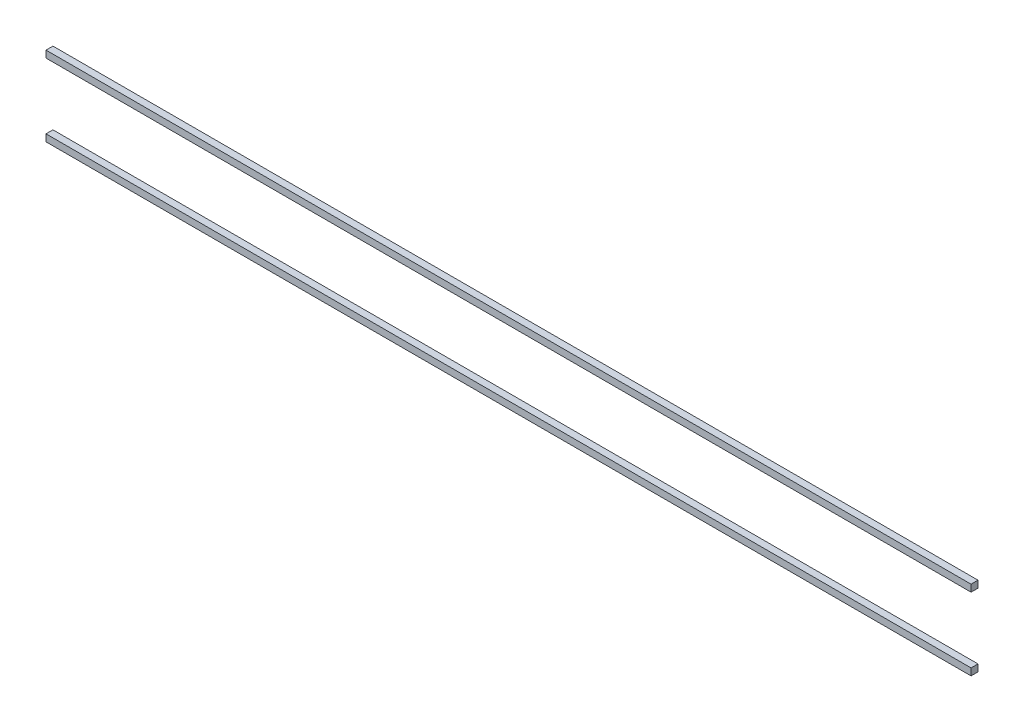
ISO-10303-21;
HEADER;
FILE_DESCRIPTION(('STEP AP214'),'2;1');
FILE_NAME('part.step','',(''),(''),'','','');
FILE_SCHEMA(('AUTOMOTIVE_DESIGN { 1 0 10303 214 1 1 1 1 }'));
ENDSEC;
DATA;
#1=APPLICATION_CONTEXT('core data for automotive mechanical design processes');
#2=APPLICATION_PROTOCOL_DEFINITION('international standard','automotive_design',2000,#1);
#3=PRODUCT_CONTEXT('',#1,'mechanical');
#4=PRODUCT('Part','Part','',(#3));
#5=PRODUCT_RELATED_PRODUCT_CATEGORY('part','',(#4));
#6=PRODUCT_DEFINITION_FORMATION('','',#4);
#7=PRODUCT_DEFINITION_CONTEXT('part definition',#1,'design');
#8=PRODUCT_DEFINITION('design','',#6,#7);
#9=PRODUCT_DEFINITION_SHAPE('','',#8);
#10=(LENGTH_UNIT() NAMED_UNIT(*) SI_UNIT(.MILLI.,.METRE.));
#11=(NAMED_UNIT(*) PLANE_ANGLE_UNIT() SI_UNIT($,.RADIAN.));
#12=(NAMED_UNIT(*) SI_UNIT($,.STERADIAN.) SOLID_ANGLE_UNIT());
#13=UNCERTAINTY_MEASURE_WITH_UNIT(LENGTH_MEASURE(1.E-05),#10,'distance_accuracy_value','');
#14=(GEOMETRIC_REPRESENTATION_CONTEXT(3) GLOBAL_UNCERTAINTY_ASSIGNED_CONTEXT((#13)) GLOBAL_UNIT_ASSIGNED_CONTEXT((#10,
#11,#12)) REPRESENTATION_CONTEXT('',''));
#15=CARTESIAN_POINT('',(0.,0.,0.));
#16=DIRECTION('',(0.,0.,1.));
#17=DIRECTION('',(1.,0.,0.));
#18=AXIS2_PLACEMENT_3D('',#15,#16,#17);
#19=CARTESIAN_POINT('',(0.,15.,3.175));
#20=DIRECTION('',(0.,1.,0.));
#21=DIRECTION('',(0.,0.,1.));
#22=AXIS2_PLACEMENT_3D('',#19,#20,#21);
#23=PLANE('',#22);
#24=DIRECTION('',(1.,0.,0.));
#25=VECTOR('',#24,1.);
#26=CARTESIAN_POINT('',(0.,15.,0.));
#27=LINE('',#26,#25);
#28=CARTESIAN_POINT('',(-18.175,15.,0.));
#29=VERTEX_POINT('',#28);
#30=CARTESIAN_POINT('',(405.,15.,0.));
#31=VERTEX_POINT('',#30);
#32=EDGE_CURVE('E122',#29,#31,#27,.T.);
#33=ORIENTED_EDGE('',*,*,#32,.F.);
#34=DIRECTION('',(0.,0.,-1.));
#35=VECTOR('',#34,1.);
#36=CARTESIAN_POINT('',(-18.175,15.,3.175));
#37=LINE('',#36,#35);
#38=CARTESIAN_POINT('',(-18.175,15.,3.175));
#39=VERTEX_POINT('',#38);
#40=EDGE_CURVE('E12',#39,#29,#37,.T.);
#41=ORIENTED_EDGE('',*,*,#40,.F.);
#42=DIRECTION('',(1.,0.,0.));
#43=VECTOR('',#42,1.);
#44=CARTESIAN_POINT('',(0.,15.,3.175));
#45=LINE('',#44,#43);
#46=CARTESIAN_POINT('',(405.,15.,3.175));
#47=VERTEX_POINT('',#46);
#48=EDGE_CURVE('E112',#39,#47,#45,.T.);
#49=ORIENTED_EDGE('',*,*,#48,.T.);
#50=DIRECTION('',(0.,0.,-1.));
#51=VECTOR('',#50,1.);
#52=CARTESIAN_POINT('',(405.,15.,3.175));
#53=LINE('',#52,#51);
#54=EDGE_CURVE('E91',#47,#31,#53,.T.);
#55=ORIENTED_EDGE('',*,*,#54,.T.);
#56=EDGE_LOOP('',(#33,#41,#49,#55));
#57=FACE_BOUND('',#56,.T.);
#58=ADVANCED_FACE('F52',(#57),#23,.T.);
#59=CARTESIAN_POINT('',(-18.175,0.,3.175));
#60=DIRECTION('',(-1.,0.,0.));
#61=DIRECTION('',(0.,0.,1.));
#62=AXIS2_PLACEMENT_3D('',#59,#60,#61);
#63=PLANE('',#62);
#64=DIRECTION('',(0.,1.,0.));
#65=VECTOR('',#64,1.);
#66=CARTESIAN_POINT('',(-18.175,0.,0.));
#67=LINE('',#66,#65);
#68=CARTESIAN_POINT('',(-18.175,11.825,0.));
#69=VERTEX_POINT('',#68);
#70=EDGE_CURVE('E104',#69,#29,#67,.T.);
#71=ORIENTED_EDGE('',*,*,#70,.F.);
#72=DIRECTION('',(0.,0.,-1.));
#73=VECTOR('',#72,1.);
#74=CARTESIAN_POINT('',(-18.175,11.825,3.175));
#75=LINE('',#74,#73);
#76=CARTESIAN_POINT('',(-18.175,11.825,3.175));
#77=VERTEX_POINT('',#76);
#78=EDGE_CURVE('E61',#77,#69,#75,.T.);
#79=ORIENTED_EDGE('',*,*,#78,.F.);
#80=DIRECTION('',(0.,1.,0.));
#81=VECTOR('',#80,1.);
#82=CARTESIAN_POINT('',(-18.175,0.,3.175));
#83=LINE('',#82,#81);
#84=EDGE_CURVE('E102',#77,#39,#83,.T.);
#85=ORIENTED_EDGE('',*,*,#84,.T.);
#86=ORIENTED_EDGE('',*,*,#40,.T.);
#87=EDGE_LOOP('',(#71,#79,#85,#86));
#88=FACE_BOUND('',#87,.T.);
#89=ADVANCED_FACE('F100',(#88),#63,.T.);
#90=CARTESIAN_POINT('',(0.,11.825,3.175));
#91=DIRECTION('',(0.,1.,0.));
#92=DIRECTION('',(-1.,0.,0.));
#93=AXIS2_PLACEMENT_3D('',#90,#91,#92);
#94=PLANE('',#93);
#95=DIRECTION('',(1.,0.,0.));
#96=VECTOR('',#95,1.);
#97=CARTESIAN_POINT('',(0.,11.825,0.));
#98=LINE('',#97,#96);
#99=CARTESIAN_POINT('',(405.,11.825,0.));
#100=VERTEX_POINT('',#99);
#101=EDGE_CURVE('E84',#69,#100,#98,.T.);
#102=ORIENTED_EDGE('',*,*,#101,.T.);
#103=DIRECTION('',(0.,0.,-1.));
#104=VECTOR('',#103,1.);
#105=CARTESIAN_POINT('',(405.,11.825,3.175));
#106=LINE('',#105,#104);
#107=CARTESIAN_POINT('',(405.,11.825,3.175));
#108=VERTEX_POINT('',#107);
#109=EDGE_CURVE('E106',#108,#100,#106,.T.);
#110=ORIENTED_EDGE('',*,*,#109,.F.);
#111=DIRECTION('',(1.,0.,0.));
#112=VECTOR('',#111,1.);
#113=CARTESIAN_POINT('',(0.,11.825,3.175));
#114=LINE('',#113,#112);
#115=EDGE_CURVE('E107',#77,#108,#114,.T.);
#116=ORIENTED_EDGE('',*,*,#115,.F.);
#117=ORIENTED_EDGE('',*,*,#78,.T.);
#118=EDGE_LOOP('',(#102,#110,#116,#117));
#119=FACE_BOUND('',#118,.T.);
#120=ADVANCED_FACE('F108',(#119),#94,.F.);
#121=CARTESIAN_POINT('',(405.,0.,3.175));
#122=DIRECTION('',(-1.,0.,0.));
#123=DIRECTION('',(0.,0.,1.));
#124=AXIS2_PLACEMENT_3D('',#121,#122,#123);
#125=PLANE('',#124);
#126=DIRECTION('',(0.,1.,0.));
#127=VECTOR('',#126,1.);
#128=CARTESIAN_POINT('',(405.,0.,0.));
#129=LINE('',#128,#127);
#130=EDGE_CURVE('E117',#100,#31,#129,.T.);
#131=ORIENTED_EDGE('',*,*,#130,.T.);
#132=ORIENTED_EDGE('',*,*,#54,.F.);
#133=DIRECTION('',(0.,1.,0.));
#134=VECTOR('',#133,1.);
#135=CARTESIAN_POINT('',(405.,0.,3.175));
#136=LINE('',#135,#134);
#137=EDGE_CURVE('E69',#108,#47,#136,.T.);
#138=ORIENTED_EDGE('',*,*,#137,.F.);
#139=ORIENTED_EDGE('',*,*,#109,.T.);
#140=EDGE_LOOP('',(#131,#132,#138,#139));
#141=FACE_BOUND('',#140,.T.);
#142=ADVANCED_FACE('F136',(#141),#125,.F.);
#143=CARTESIAN_POINT('',(0.,0.,3.175));
#144=DIRECTION('',(0.,0.,1.));
#145=DIRECTION('',(1.,0.,0.));
#146=AXIS2_PLACEMENT_3D('',#143,#144,#145);
#147=PLANE('',#146);
#148=ORIENTED_EDGE('',*,*,#48,.F.);
#149=ORIENTED_EDGE('',*,*,#84,.F.);
#150=ORIENTED_EDGE('',*,*,#115,.T.);
#151=ORIENTED_EDGE('',*,*,#137,.T.);
#152=EDGE_LOOP('',(#148,#149,#150,#151));
#153=FACE_BOUND('',#152,.T.);
#154=ADVANCED_FACE('F111',(#153),#147,.T.);
#155=CARTESIAN_POINT('',(0.,0.,0.));
#156=DIRECTION('',(0.,0.,1.));
#157=DIRECTION('',(1.,0.,0.));
#158=AXIS2_PLACEMENT_3D('',#155,#156,#157);
#159=PLANE('',#158);
#160=ORIENTED_EDGE('',*,*,#32,.T.);
#161=ORIENTED_EDGE('',*,*,#130,.F.);
#162=ORIENTED_EDGE('',*,*,#101,.F.);
#163=ORIENTED_EDGE('',*,*,#70,.T.);
#164=EDGE_LOOP('',(#160,#161,#162,#163));
#165=FACE_BOUND('',#164,.T.);
#166=ADVANCED_FACE('F138',(#165),#159,.F.);
#167=CLOSED_SHELL('',(#58,#89,#120,#142,#154,#166));
#168=MANIFOLD_SOLID_BREP('B2',#167);
#169=CARTESIAN_POINT('',(0.,45.,3.175));
#170=DIRECTION('',(0.,1.,0.));
#171=DIRECTION('',(0.,0.,1.));
#172=AXIS2_PLACEMENT_3D('',#169,#170,#171);
#173=PLANE('',#172);
#174=DIRECTION('',(1.,0.,0.));
#175=VECTOR('',#174,1.);
#176=CARTESIAN_POINT('',(0.,45.,0.));
#177=LINE('',#176,#175);
#178=CARTESIAN_POINT('',(-18.175,45.,0.));
#179=VERTEX_POINT('',#178);
#180=CARTESIAN_POINT('',(405.,45.,0.));
#181=VERTEX_POINT('',#180);
#182=EDGE_CURVE('E276',#179,#181,#177,.T.);
#183=ORIENTED_EDGE('',*,*,#182,.T.);
#184=DIRECTION('',(0.,0.,-1.));
#185=VECTOR('',#184,1.);
#186=CARTESIAN_POINT('',(405.,45.,3.175));
#187=LINE('',#186,#185);
#188=CARTESIAN_POINT('',(405.,45.,3.175));
#189=VERTEX_POINT('',#188);
#190=EDGE_CURVE('E50',#189,#181,#187,.T.);
#191=ORIENTED_EDGE('',*,*,#190,.F.);
#192=DIRECTION('',(1.,0.,0.));
#193=VECTOR('',#192,1.);
#194=CARTESIAN_POINT('',(0.,45.,3.175));
#195=LINE('',#194,#193);
#196=CARTESIAN_POINT('',(-18.175,45.,3.175));
#197=VERTEX_POINT('',#196);
#198=EDGE_CURVE('E255',#197,#189,#195,.T.);
#199=ORIENTED_EDGE('',*,*,#198,.F.);
#200=DIRECTION('',(0.,0.,-1.));
#201=VECTOR('',#200,1.);
#202=CARTESIAN_POINT('',(-18.175,45.,3.175));
#203=LINE('',#202,#201);
#204=EDGE_CURVE('E272',#197,#179,#203,.T.);
#205=ORIENTED_EDGE('',*,*,#204,.T.);
#206=EDGE_LOOP('',(#183,#191,#199,#205));
#207=FACE_BOUND('',#206,.T.);
#208=ADVANCED_FACE('F207',(#207),#173,.F.);
#209=CARTESIAN_POINT('',(405.,0.,3.175));
#210=DIRECTION('',(-1.,0.,0.));
#211=DIRECTION('',(0.,0.,1.));
#212=AXIS2_PLACEMENT_3D('',#209,#210,#211);
#213=PLANE('',#212);
#214=DIRECTION('',(0.,1.,0.));
#215=VECTOR('',#214,1.);
#216=CARTESIAN_POINT('',(405.,0.,0.));
#217=LINE('',#216,#215);
#218=CARTESIAN_POINT('',(405.,48.175,0.));
#219=VERTEX_POINT('',#218);
#220=EDGE_CURVE('E261',#181,#219,#217,.T.);
#221=ORIENTED_EDGE('',*,*,#220,.T.);
#222=DIRECTION('',(0.,0.,-1.));
#223=VECTOR('',#222,1.);
#224=CARTESIAN_POINT('',(405.,48.175,3.175));
#225=LINE('',#224,#223);
#226=CARTESIAN_POINT('',(405.,48.175,3.175));
#227=VERTEX_POINT('',#226);
#228=EDGE_CURVE('E216',#227,#219,#225,.T.);
#229=ORIENTED_EDGE('',*,*,#228,.F.);
#230=DIRECTION('',(0.,1.,0.));
#231=VECTOR('',#230,1.);
#232=CARTESIAN_POINT('',(405.,0.,3.175));
#233=LINE('',#232,#231);
#234=EDGE_CURVE('E250',#189,#227,#233,.T.);
#235=ORIENTED_EDGE('',*,*,#234,.F.);
#236=ORIENTED_EDGE('',*,*,#190,.T.);
#237=EDGE_LOOP('',(#221,#229,#235,#236));
#238=FACE_BOUND('',#237,.T.);
#239=ADVANCED_FACE('F260',(#238),#213,.F.);
#240=CARTESIAN_POINT('',(0.,48.175,3.175));
#241=DIRECTION('',(0.,1.,0.));
#242=DIRECTION('',(0.,0.,1.));
#243=AXIS2_PLACEMENT_3D('',#240,#241,#242);
#244=PLANE('',#243);
#245=DIRECTION('',(1.,0.,0.));
#246=VECTOR('',#245,1.);
#247=CARTESIAN_POINT('',(0.,48.175,0.));
#248=LINE('',#247,#246);
#249=CARTESIAN_POINT('',(-18.175,48.175,0.));
#250=VERTEX_POINT('',#249);
#251=EDGE_CURVE('E281',#250,#219,#248,.T.);
#252=ORIENTED_EDGE('',*,*,#251,.F.);
#253=DIRECTION('',(0.,0.,-1.));
#254=VECTOR('',#253,1.);
#255=CARTESIAN_POINT('',(-18.175,48.175,3.175));
#256=LINE('',#255,#254);
#257=CARTESIAN_POINT('',(-18.175,48.175,3.175));
#258=VERTEX_POINT('',#257);
#259=EDGE_CURVE('E240',#258,#250,#256,.T.);
#260=ORIENTED_EDGE('',*,*,#259,.F.);
#261=DIRECTION('',(1.,0.,0.));
#262=VECTOR('',#261,1.);
#263=CARTESIAN_POINT('',(0.,48.175,3.175));
#264=LINE('',#263,#262);
#265=EDGE_CURVE('E253',#258,#227,#264,.T.);
#266=ORIENTED_EDGE('',*,*,#265,.T.);
#267=ORIENTED_EDGE('',*,*,#228,.T.);
#268=EDGE_LOOP('',(#252,#260,#266,#267));
#269=FACE_BOUND('',#268,.T.);
#270=ADVANCED_FACE('F266',(#269),#244,.T.);
#271=CARTESIAN_POINT('',(-18.175,0.,3.175));
#272=DIRECTION('',(1.,0.,0.));
#273=DIRECTION('',(0.,0.,-1.));
#274=AXIS2_PLACEMENT_3D('',#271,#272,#273);
#275=PLANE('',#274);
#276=DIRECTION('',(0.,-1.,0.));
#277=VECTOR('',#276,1.);
#278=CARTESIAN_POINT('',(-18.175,0.,0.));
#279=LINE('',#278,#277);
#280=EDGE_CURVE('E243',#250,#179,#279,.T.);
#281=ORIENTED_EDGE('',*,*,#280,.T.);
#282=ORIENTED_EDGE('',*,*,#204,.F.);
#283=DIRECTION('',(0.,-1.,0.));
#284=VECTOR('',#283,1.);
#285=CARTESIAN_POINT('',(-18.175,0.,3.175));
#286=LINE('',#285,#284);
#287=EDGE_CURVE('E224',#258,#197,#286,.T.);
#288=ORIENTED_EDGE('',*,*,#287,.F.);
#289=ORIENTED_EDGE('',*,*,#259,.T.);
#290=EDGE_LOOP('',(#281,#282,#288,#289));
#291=FACE_BOUND('',#290,.T.);
#292=ADVANCED_FACE('F297',(#291),#275,.F.);
#293=CARTESIAN_POINT('',(0.,0.,3.175));
#294=DIRECTION('',(0.,0.,1.));
#295=DIRECTION('',(1.,0.,0.));
#296=AXIS2_PLACEMENT_3D('',#293,#294,#295);
#297=PLANE('',#296);
#298=ORIENTED_EDGE('',*,*,#198,.T.);
#299=ORIENTED_EDGE('',*,*,#234,.T.);
#300=ORIENTED_EDGE('',*,*,#265,.F.);
#301=ORIENTED_EDGE('',*,*,#287,.T.);
#302=EDGE_LOOP('',(#298,#299,#300,#301));
#303=FACE_BOUND('',#302,.T.);
#304=ADVANCED_FACE('F251',(#303),#297,.T.);
#305=CARTESIAN_POINT('',(0.,0.,0.));
#306=DIRECTION('',(0.,0.,1.));
#307=DIRECTION('',(1.,0.,0.));
#308=AXIS2_PLACEMENT_3D('',#305,#306,#307);
#309=PLANE('',#308);
#310=ORIENTED_EDGE('',*,*,#182,.F.);
#311=ORIENTED_EDGE('',*,*,#280,.F.);
#312=ORIENTED_EDGE('',*,*,#251,.T.);
#313=ORIENTED_EDGE('',*,*,#220,.F.);
#314=EDGE_LOOP('',(#310,#311,#312,#313));
#315=FACE_BOUND('',#314,.T.);
#316=ADVANCED_FACE('F291',(#315),#309,.F.);
#317=CLOSED_SHELL('',(#208,#239,#270,#292,#304,#316));
#318=MANIFOLD_SOLID_BREP('B6',#317);
#319=ADVANCED_BREP_SHAPE_REPRESENTATION('',(#18,#168,#318),#14);
#320=SHAPE_DEFINITION_REPRESENTATION(#9,#319);
ENDSEC;
END-ISO-10303-21;
